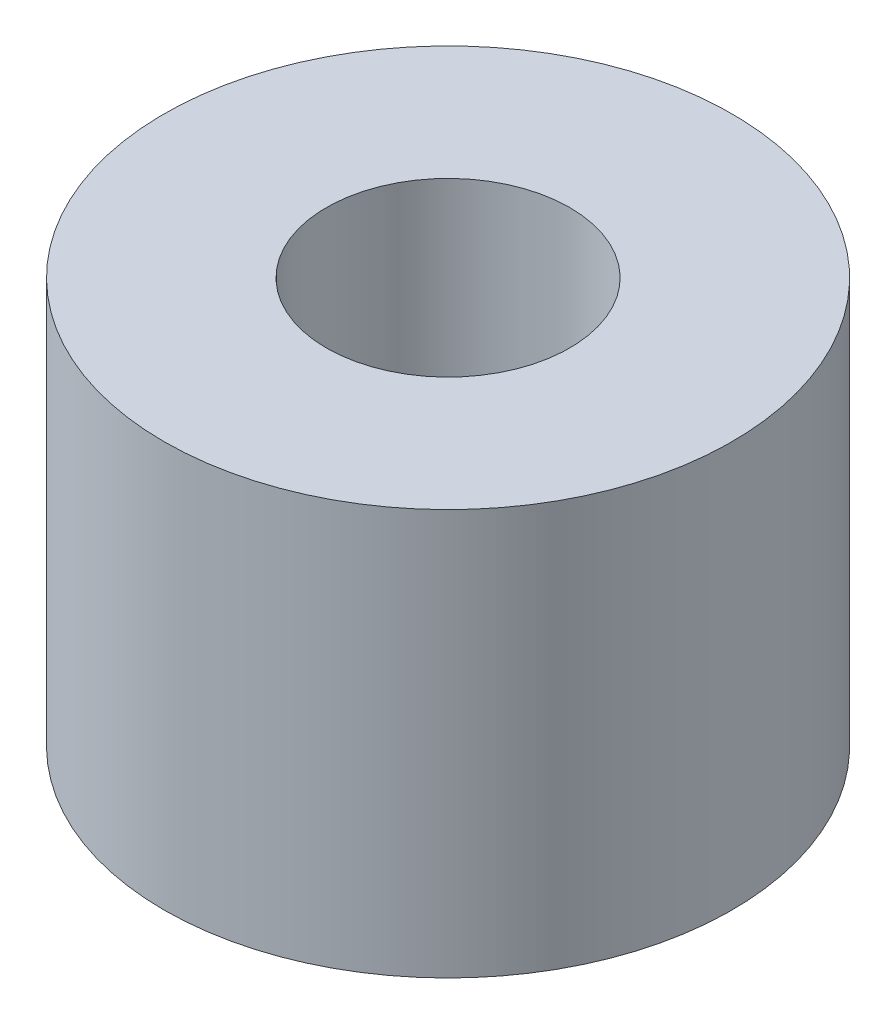
ISO-10303-21;
HEADER;
FILE_DESCRIPTION(('STEP AP214'),'2;1');
FILE_NAME('part.step','',(''),(''),'','','');
FILE_SCHEMA(('AUTOMOTIVE_DESIGN { 1 0 10303 214 1 1 1 1 }'));
ENDSEC;
DATA;
#1=APPLICATION_CONTEXT('core data for automotive mechanical design processes');
#2=APPLICATION_PROTOCOL_DEFINITION('international standard','automotive_design',2000,#1);
#3=PRODUCT_CONTEXT('',#1,'mechanical');
#4=PRODUCT('Part','Part','',(#3));
#5=PRODUCT_RELATED_PRODUCT_CATEGORY('part','',(#4));
#6=PRODUCT_DEFINITION_FORMATION('','',#4);
#7=PRODUCT_DEFINITION_CONTEXT('part definition',#1,'design');
#8=PRODUCT_DEFINITION('design','',#6,#7);
#9=PRODUCT_DEFINITION_SHAPE('','',#8);
#10=(LENGTH_UNIT() NAMED_UNIT(*) SI_UNIT(.MILLI.,.METRE.));
#11=(NAMED_UNIT(*) PLANE_ANGLE_UNIT() SI_UNIT($,.RADIAN.));
#12=(NAMED_UNIT(*) SI_UNIT($,.STERADIAN.) SOLID_ANGLE_UNIT());
#13=UNCERTAINTY_MEASURE_WITH_UNIT(LENGTH_MEASURE(1.E-05),#10,'distance_accuracy_value','');
#14=(GEOMETRIC_REPRESENTATION_CONTEXT(3) GLOBAL_UNCERTAINTY_ASSIGNED_CONTEXT((#13)) GLOBAL_UNIT_ASSIGNED_CONTEXT((#10,
#11,#12)) REPRESENTATION_CONTEXT('',''));
#15=CARTESIAN_POINT('',(0.,0.,0.));
#16=DIRECTION('',(0.,0.,1.));
#17=DIRECTION('',(1.,0.,0.));
#18=AXIS2_PLACEMENT_3D('',#15,#16,#17);
#19=CARTESIAN_POINT('',(0.,5.,0.));
#20=DIRECTION('',(0.,1.,0.));
#21=DIRECTION('',(0.,0.,1.));
#22=AXIS2_PLACEMENT_3D('',#19,#20,#21);
#23=PLANE('',#22);
#24=CARTESIAN_POINT('',(0.,5.,0.));
#25=DIRECTION('',(0.,1.,0.));
#26=DIRECTION('',(0.,0.,1.));
#27=AXIS2_PLACEMENT_3D('',#24,#25,#26);
#28=CIRCLE('',#27,3.5);
#29=CARTESIAN_POINT('',(0.,5.,3.5));
#30=VERTEX_POINT('',#29);
#31=EDGE_CURVE('E10',#30,#30,#28,.T.);
#32=ORIENTED_EDGE('',*,*,#31,.T.);
#33=EDGE_LOOP('',(#32));
#34=FACE_BOUND('',#33,.T.);
#35=CARTESIAN_POINT('',(0.,5.,0.));
#36=DIRECTION('',(0.,1.,0.));
#37=DIRECTION('',(0.,0.,1.));
#38=AXIS2_PLACEMENT_3D('',#35,#36,#37);
#39=CIRCLE('',#38,1.5);
#40=CARTESIAN_POINT('',(0.,5.,1.5));
#41=VERTEX_POINT('',#40);
#42=EDGE_CURVE('E54',#41,#41,#39,.T.);
#43=ORIENTED_EDGE('',*,*,#42,.F.);
#44=EDGE_LOOP('',(#43));
#45=FACE_BOUND('',#44,.T.);
#46=ADVANCED_FACE('F41',(#34,#45),#23,.T.);
#47=CARTESIAN_POINT('',(0.,0.,0.));
#48=DIRECTION('',(0.,1.,0.));
#49=DIRECTION('',(0.,0.,1.));
#50=AXIS2_PLACEMENT_3D('',#47,#48,#49);
#51=PLANE('',#50);
#52=CARTESIAN_POINT('',(0.,0.,0.));
#53=DIRECTION('',(0.,1.,0.));
#54=DIRECTION('',(0.,0.,1.));
#55=AXIS2_PLACEMENT_3D('',#52,#53,#54);
#56=CIRCLE('',#55,3.5);
#57=CARTESIAN_POINT('',(0.,0.,3.5));
#58=VERTEX_POINT('',#57);
#59=EDGE_CURVE('E45',#58,#58,#56,.T.);
#60=ORIENTED_EDGE('',*,*,#59,.F.);
#61=EDGE_LOOP('',(#60));
#62=FACE_BOUND('',#61,.T.);
#63=CARTESIAN_POINT('',(0.,0.,0.));
#64=DIRECTION('',(0.,1.,0.));
#65=DIRECTION('',(0.,0.,1.));
#66=AXIS2_PLACEMENT_3D('',#63,#64,#65);
#67=CIRCLE('',#66,1.5);
#68=CARTESIAN_POINT('',(0.,0.,1.5));
#69=VERTEX_POINT('',#68);
#70=EDGE_CURVE('E56',#69,#69,#67,.T.);
#71=ORIENTED_EDGE('',*,*,#70,.T.);
#72=EDGE_LOOP('',(#71));
#73=FACE_BOUND('',#72,.T.);
#74=ADVANCED_FACE('F68',(#62,#73),#51,.F.);
#75=CARTESIAN_POINT('',(0.,5.,0.));
#76=DIRECTION('',(0.,-1.,0.));
#77=DIRECTION('',(0.,0.,-1.));
#78=AXIS2_PLACEMENT_3D('',#75,#76,#77);
#79=CYLINDRICAL_SURFACE('',#78,3.5);
#80=ORIENTED_EDGE('',*,*,#31,.F.);
#81=EDGE_LOOP('',(#80));
#82=FACE_BOUND('',#81,.T.);
#83=ORIENTED_EDGE('',*,*,#59,.T.);
#84=EDGE_LOOP('',(#83));
#85=FACE_BOUND('',#84,.T.);
#86=ADVANCED_FACE('F43',(#82,#85),#79,.T.);
#87=CARTESIAN_POINT('',(0.,5.,0.));
#88=DIRECTION('',(0.,-1.,0.));
#89=DIRECTION('',(0.,0.,-1.));
#90=AXIS2_PLACEMENT_3D('',#87,#88,#89);
#91=CYLINDRICAL_SURFACE('',#90,1.5);
#92=ORIENTED_EDGE('',*,*,#42,.T.);
#93=EDGE_LOOP('',(#92));
#94=FACE_BOUND('',#93,.T.);
#95=ORIENTED_EDGE('',*,*,#70,.F.);
#96=EDGE_LOOP('',(#95));
#97=FACE_BOUND('',#96,.T.);
#98=ADVANCED_FACE('F64',(#94,#97),#91,.F.);
#99=CLOSED_SHELL('',(#46,#74,#86,#98));
#100=MANIFOLD_SOLID_BREP('B2',#99);
#101=ADVANCED_BREP_SHAPE_REPRESENTATION('',(#18,#100),#14);
#102=SHAPE_DEFINITION_REPRESENTATION(#9,#101);
ENDSEC;
END-ISO-10303-21;
